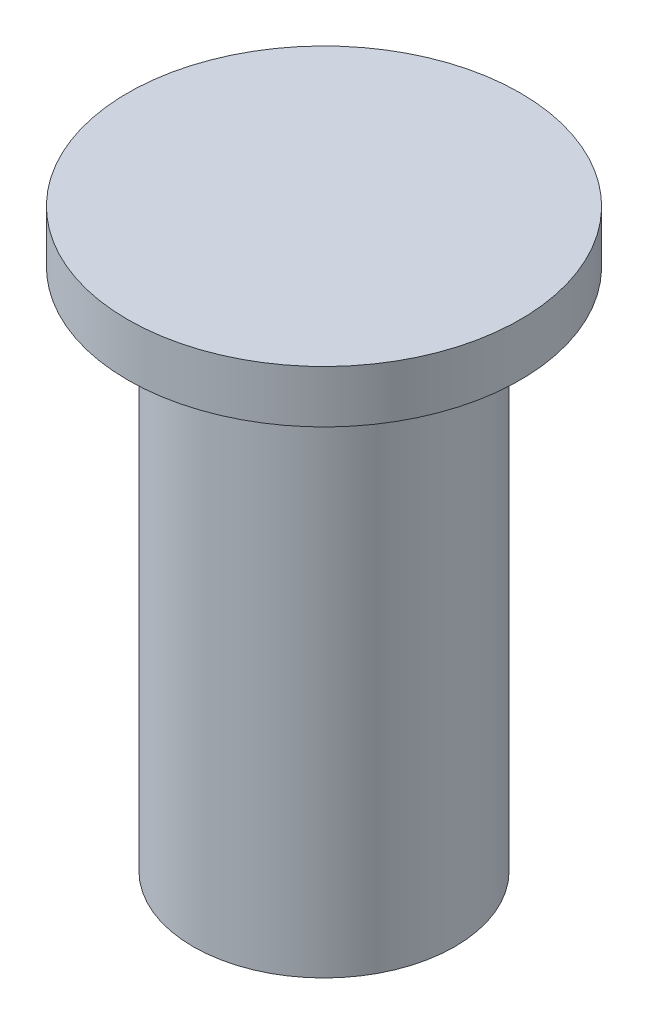
ISO-10303-21;
HEADER;
FILE_DESCRIPTION(('STEP AP214'),'2;1');
FILE_NAME('part.step','',(''),(''),'','','');
FILE_SCHEMA(('AUTOMOTIVE_DESIGN { 1 0 10303 214 1 1 1 1 }'));
ENDSEC;
DATA;
#1=APPLICATION_CONTEXT('core data for automotive mechanical design processes');
#2=APPLICATION_PROTOCOL_DEFINITION('international standard','automotive_design',2000,#1);
#3=PRODUCT_CONTEXT('',#1,'mechanical');
#4=PRODUCT('Part','Part','',(#3));
#5=PRODUCT_RELATED_PRODUCT_CATEGORY('part','',(#4));
#6=PRODUCT_DEFINITION_FORMATION('','',#4);
#7=PRODUCT_DEFINITION_CONTEXT('part definition',#1,'design');
#8=PRODUCT_DEFINITION('design','',#6,#7);
#9=PRODUCT_DEFINITION_SHAPE('','',#8);
#10=(LENGTH_UNIT() NAMED_UNIT(*) SI_UNIT(.MILLI.,.METRE.));
#11=(NAMED_UNIT(*) PLANE_ANGLE_UNIT() SI_UNIT($,.RADIAN.));
#12=(NAMED_UNIT(*) SI_UNIT($,.STERADIAN.) SOLID_ANGLE_UNIT());
#13=UNCERTAINTY_MEASURE_WITH_UNIT(LENGTH_MEASURE(1.E-05),#10,'distance_accuracy_value','');
#14=(GEOMETRIC_REPRESENTATION_CONTEXT(3) GLOBAL_UNCERTAINTY_ASSIGNED_CONTEXT((#13)) GLOBAL_UNIT_ASSIGNED_CONTEXT((#10,
#11,#12)) REPRESENTATION_CONTEXT('',''));
#15=CARTESIAN_POINT('',(0.,0.,0.));
#16=DIRECTION('',(0.,0.,1.));
#17=DIRECTION('',(1.,0.,0.));
#18=AXIS2_PLACEMENT_3D('',#15,#16,#17);
#19=CARTESIAN_POINT('',(0.,25.4,0.));
#20=DIRECTION('',(0.,-1.,0.));
#21=DIRECTION('',(0.,0.,-1.));
#22=AXIS2_PLACEMENT_3D('',#19,#20,#21);
#23=CYLINDRICAL_SURFACE('',#22,6.35);
#24=CARTESIAN_POINT('',(0.,25.4,0.));
#25=DIRECTION('',(0.,1.,0.));
#26=DIRECTION('',(0.,0.,1.));
#27=AXIS2_PLACEMENT_3D('',#24,#25,#26);
#28=CIRCLE('',#27,6.35);
#29=CARTESIAN_POINT('',(0.,25.4,6.35));
#30=VERTEX_POINT('',#29);
#31=EDGE_CURVE('E10',#30,#30,#28,.T.);
#32=ORIENTED_EDGE('',*,*,#31,.F.);
#33=EDGE_LOOP('',(#32));
#34=FACE_BOUND('',#33,.T.);
#35=CARTESIAN_POINT('',(0.,0.,0.));
#36=DIRECTION('',(0.,1.,0.));
#37=DIRECTION('',(0.,0.,1.));
#38=AXIS2_PLACEMENT_3D('',#35,#36,#37);
#39=CIRCLE('',#38,6.35);
#40=CARTESIAN_POINT('',(0.,0.,6.35));
#41=VERTEX_POINT('',#40);
#42=EDGE_CURVE('E34',#41,#41,#39,.T.);
#43=ORIENTED_EDGE('',*,*,#42,.T.);
#44=EDGE_LOOP('',(#43));
#45=FACE_BOUND('',#44,.T.);
#46=ADVANCED_FACE('F31',(#34,#45),#23,.T.);
#47=CARTESIAN_POINT('',(0.,0.,0.));
#48=DIRECTION('',(0.,1.,0.));
#49=DIRECTION('',(0.,0.,1.));
#50=AXIS2_PLACEMENT_3D('',#47,#48,#49);
#51=PLANE('',#50);
#52=ORIENTED_EDGE('',*,*,#42,.F.);
#53=EDGE_LOOP('',(#52));
#54=FACE_BOUND('',#53,.T.);
#55=ADVANCED_FACE('F54',(#54),#51,.F.);
#56=CARTESIAN_POINT('',(0.,27.94,0.));
#57=DIRECTION('',(0.,-1.,0.));
#58=DIRECTION('',(0.,0.,-1.));
#59=AXIS2_PLACEMENT_3D('',#56,#57,#58);
#60=CYLINDRICAL_SURFACE('',#59,9.525);
#61=CARTESIAN_POINT('',(0.,27.94,0.));
#62=DIRECTION('',(0.,1.,0.));
#63=DIRECTION('',(0.,0.,1.));
#64=AXIS2_PLACEMENT_3D('',#61,#62,#63);
#65=CIRCLE('',#64,9.525);
#66=CARTESIAN_POINT('',(0.,27.94,9.525));
#67=VERTEX_POINT('',#66);
#68=EDGE_CURVE('E41',#67,#67,#65,.T.);
#69=ORIENTED_EDGE('',*,*,#68,.F.);
#70=EDGE_LOOP('',(#69));
#71=FACE_BOUND('',#70,.T.);
#72=CARTESIAN_POINT('',(0.,25.4,0.));
#73=DIRECTION('',(0.,1.,0.));
#74=DIRECTION('',(0.,0.,1.));
#75=AXIS2_PLACEMENT_3D('',#72,#73,#74);
#76=CIRCLE('',#75,9.525);
#77=CARTESIAN_POINT('',(0.,25.4,9.525));
#78=VERTEX_POINT('',#77);
#79=EDGE_CURVE('E43',#78,#78,#76,.T.);
#80=ORIENTED_EDGE('',*,*,#79,.T.);
#81=EDGE_LOOP('',(#80));
#82=FACE_BOUND('',#81,.T.);
#83=ADVANCED_FACE('F51',(#71,#82),#60,.T.);
#84=CARTESIAN_POINT('',(0.,27.94,0.));
#85=DIRECTION('',(0.,1.,0.));
#86=DIRECTION('',(0.,0.,1.));
#87=AXIS2_PLACEMENT_3D('',#84,#85,#86);
#88=PLANE('',#87);
#89=ORIENTED_EDGE('',*,*,#68,.T.);
#90=EDGE_LOOP('',(#89));
#91=FACE_BOUND('',#90,.T.);
#92=ADVANCED_FACE('F49',(#91),#88,.T.);
#93=CARTESIAN_POINT('',(0.,25.4,0.));
#94=DIRECTION('',(0.,1.,0.));
#95=DIRECTION('',(0.,0.,1.));
#96=AXIS2_PLACEMENT_3D('',#93,#94,#95);
#97=PLANE('',#96);
#98=ORIENTED_EDGE('',*,*,#31,.T.);
#99=EDGE_LOOP('',(#98));
#100=FACE_BOUND('',#99,.T.);
#101=ORIENTED_EDGE('',*,*,#79,.F.);
#102=EDGE_LOOP('',(#101));
#103=FACE_BOUND('',#102,.T.);
#104=ADVANCED_FACE('F58',(#100,#103),#97,.F.);
#105=CLOSED_SHELL('',(#46,#55,#83,#92,#104));
#106=MANIFOLD_SOLID_BREP('B2',#105);
#107=ADVANCED_BREP_SHAPE_REPRESENTATION('',(#18,#106),#14);
#108=SHAPE_DEFINITION_REPRESENTATION(#9,#107);
ENDSEC;
END-ISO-10303-21;
